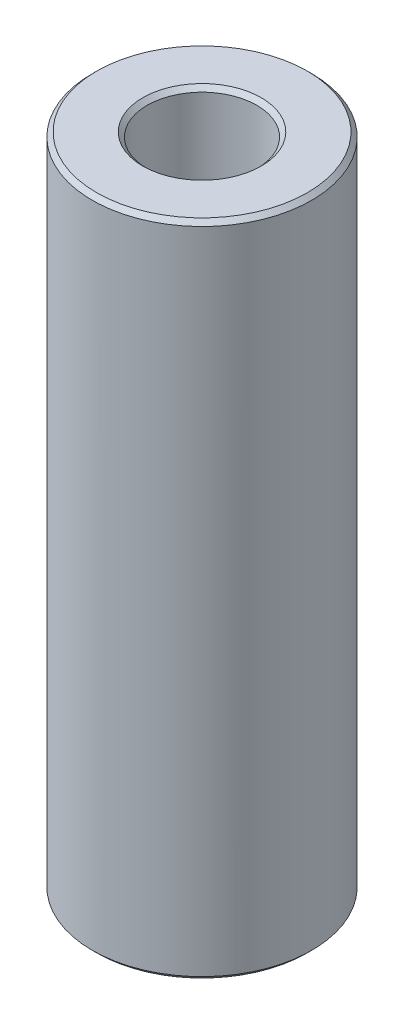
ISO-10303-21;
HEADER;
FILE_DESCRIPTION(('STEP AP214'),'2;1');
FILE_NAME('part.step','',(''),(''),'','','');
FILE_SCHEMA(('AUTOMOTIVE_DESIGN { 1 0 10303 214 1 1 1 1 }'));
ENDSEC;
DATA;
#1=APPLICATION_CONTEXT('core data for automotive mechanical design processes');
#2=APPLICATION_PROTOCOL_DEFINITION('international standard','automotive_design',2000,#1);
#3=PRODUCT_CONTEXT('',#1,'mechanical');
#4=PRODUCT('Part','Part','',(#3));
#5=PRODUCT_RELATED_PRODUCT_CATEGORY('part','',(#4));
#6=PRODUCT_DEFINITION_FORMATION('','',#4);
#7=PRODUCT_DEFINITION_CONTEXT('part definition',#1,'design');
#8=PRODUCT_DEFINITION('design','',#6,#7);
#9=PRODUCT_DEFINITION_SHAPE('','',#8);
#10=(LENGTH_UNIT() NAMED_UNIT(*) SI_UNIT(.MILLI.,.METRE.));
#11=(NAMED_UNIT(*) PLANE_ANGLE_UNIT() SI_UNIT($,.RADIAN.));
#12=(NAMED_UNIT(*) SI_UNIT($,.STERADIAN.) SOLID_ANGLE_UNIT());
#13=UNCERTAINTY_MEASURE_WITH_UNIT(LENGTH_MEASURE(1.E-05),#10,'distance_accuracy_value','');
#14=(GEOMETRIC_REPRESENTATION_CONTEXT(3) GLOBAL_UNCERTAINTY_ASSIGNED_CONTEXT((#13)) GLOBAL_UNIT_ASSIGNED_CONTEXT((#10,
#11,#12)) REPRESENTATION_CONTEXT('',''));
#15=CARTESIAN_POINT('',(0.,0.,0.));
#16=DIRECTION('',(0.,0.,1.));
#17=DIRECTION('',(1.,0.,0.));
#18=AXIS2_PLACEMENT_3D('',#15,#16,#17);
#19=CARTESIAN_POINT('',(0.,38.1,0.));
#20=DIRECTION('',(0.,-1.,0.));
#21=DIRECTION('',(0.,0.,-1.));
#22=AXIS2_PLACEMENT_3D('',#19,#20,#21);
#23=CYLINDRICAL_SURFACE('',#22,3.175);
#24=CARTESIAN_POINT('',(0.,0.253999999983989,0.));
#25=DIRECTION('',(0.,-1.,0.));
#26=DIRECTION('',(0.,0.,-1.));
#27=AXIS2_PLACEMENT_3D('',#24,#25,#26);
#28=CIRCLE('',#27,3.17499999999882);
#29=CARTESIAN_POINT('',(0.,0.253999999983989,-3.17499999999882));
#30=VERTEX_POINT('',#29);
#31=EDGE_CURVE('E29',#30,#30,#28,.T.);
#32=ORIENTED_EDGE('',*,*,#31,.T.);
#33=EDGE_LOOP('',(#32));
#34=FACE_BOUND('',#33,.T.);
#35=CARTESIAN_POINT('',(0.,37.8460000000018,0.));
#36=DIRECTION('',(0.,1.,0.));
#37=DIRECTION('',(0.,0.,1.));
#38=AXIS2_PLACEMENT_3D('',#35,#36,#37);
#39=CIRCLE('',#38,3.17500000005566);
#40=CARTESIAN_POINT('',(0.,37.8460000000018,3.17500000005566));
#41=VERTEX_POINT('',#40);
#42=EDGE_CURVE('E32',#41,#41,#39,.T.);
#43=ORIENTED_EDGE('',*,*,#42,.T.);
#44=EDGE_LOOP('',(#43));
#45=FACE_BOUND('',#44,.T.);
#46=ADVANCED_FACE('F14',(#34,#45),#23,.F.);
#47=CARTESIAN_POINT('',(0.,38.099999999929,0.));
#48=DIRECTION('',(0.,1.,0.));
#49=DIRECTION('',(0.,0.,1.));
#50=AXIS2_PLACEMENT_3D('',#47,#48,#49);
#51=CONICAL_SURFACE('',#50,3.42899999998281,0.785398163509345);
#52=ORIENTED_EDGE('',*,*,#42,.F.);
#53=EDGE_LOOP('',(#52));
#54=FACE_BOUND('',#53,.T.);
#55=CARTESIAN_POINT('',(0.,38.0999999999858,0.));
#56=DIRECTION('',(0.,1.,0.));
#57=DIRECTION('',(0.,0.,1.));
#58=AXIS2_PLACEMENT_3D('',#55,#56,#57);
#59=CIRCLE('',#58,3.42900000003965);
#60=CARTESIAN_POINT('',(0.,38.0999999999858,3.42900000003965));
#61=VERTEX_POINT('',#60);
#62=EDGE_CURVE('E17',#61,#61,#59,.F.);
#63=ORIENTED_EDGE('',*,*,#62,.F.);
#64=EDGE_LOOP('',(#63));
#65=FACE_BOUND('',#64,.T.);
#66=ADVANCED_FACE('F48',(#54,#65),#51,.F.);
#67=CARTESIAN_POINT('',(0.,0.,0.));
#68=DIRECTION('',(0.,-1.,0.));
#69=DIRECTION('',(0.,0.,-1.));
#70=AXIS2_PLACEMENT_3D('',#67,#68,#69);
#71=CONICAL_SURFACE('',#70,3.42899999998281,0.785398163397448);
#72=CARTESIAN_POINT('',(0.,0.,0.));
#73=DIRECTION('',(0.,-1.,0.));
#74=DIRECTION('',(0.,0.,-1.));
#75=AXIS2_PLACEMENT_3D('',#72,#73,#74);
#76=CIRCLE('',#75,3.42899999998281);
#77=CARTESIAN_POINT('',(0.,0.,-3.42899999998281));
#78=VERTEX_POINT('',#77);
#79=EDGE_CURVE('E39',#78,#78,#76,.T.);
#80=ORIENTED_EDGE('',*,*,#79,.T.);
#81=EDGE_LOOP('',(#80));
#82=FACE_BOUND('',#81,.T.);
#83=ORIENTED_EDGE('',*,*,#31,.F.);
#84=EDGE_LOOP('',(#83));
#85=FACE_BOUND('',#84,.T.);
#86=ADVANCED_FACE('F50',(#82,#85),#71,.F.);
#87=CARTESIAN_POINT('',(0.,38.1,0.));
#88=DIRECTION('',(0.,1.,0.));
#89=DIRECTION('',(0.,0.,1.));
#90=AXIS2_PLACEMENT_3D('',#87,#88,#89);
#91=PLANE('',#90);
#92=CARTESIAN_POINT('',(0.,38.099999999929,0.));
#93=DIRECTION('',(0.,-1.,0.));
#94=DIRECTION('',(0.,0.,-1.));
#95=AXIS2_PLACEMENT_3D('',#92,#93,#94);
#96=CIRCLE('',#95,6.09600000007049);
#97=CARTESIAN_POINT('',(0.,38.099999999929,-6.09600000007049));
#98=VERTEX_POINT('',#97);
#99=EDGE_CURVE('E37',#98,#98,#96,.T.);
#100=ORIENTED_EDGE('',*,*,#99,.F.);
#101=EDGE_LOOP('',(#100));
#102=FACE_BOUND('',#101,.T.);
#103=ORIENTED_EDGE('',*,*,#62,.T.);
#104=EDGE_LOOP('',(#103));
#105=FACE_BOUND('',#104,.T.);
#106=ADVANCED_FACE('F46',(#102,#105),#91,.T.);
#107=CARTESIAN_POINT('',(0.,0.,0.));
#108=DIRECTION('',(0.,1.,0.));
#109=DIRECTION('',(0.,0.,1.));
#110=AXIS2_PLACEMENT_3D('',#107,#108,#109);
#111=PLANE('',#110);
#112=CARTESIAN_POINT('',(0.,-5.6843418860808E-11,0.));
#113=DIRECTION('',(0.,1.,0.));
#114=DIRECTION('',(0.,0.,1.));
#115=AXIS2_PLACEMENT_3D('',#112,#113,#114);
#116=CIRCLE('',#115,6.09600000001365);
#117=CARTESIAN_POINT('',(0.,-5.6843418860808E-11,6.09600000001365));
#118=VERTEX_POINT('',#117);
#119=EDGE_CURVE('E26',#118,#118,#116,.T.);
#120=ORIENTED_EDGE('',*,*,#119,.F.);
#121=EDGE_LOOP('',(#120));
#122=FACE_BOUND('',#121,.T.);
#123=ORIENTED_EDGE('',*,*,#79,.F.);
#124=EDGE_LOOP('',(#123));
#125=FACE_BOUND('',#124,.T.);
#126=ADVANCED_FACE('F75',(#122,#125),#111,.F.);
#127=CARTESIAN_POINT('',(0.,37.8460000000587,0.));
#128=DIRECTION('',(0.,-1.,0.));
#129=DIRECTION('',(0.,0.,-1.));
#130=AXIS2_PLACEMENT_3D('',#127,#128,#129);
#131=CONICAL_SURFACE('',#130,6.34999999994079,0.785398163397448);
#132=CARTESIAN_POINT('',(0.,37.846,0.));
#133=DIRECTION('',(0.,-1.,0.));
#134=DIRECTION('',(0.,0.,-1.));
#135=AXIS2_PLACEMENT_3D('',#132,#133,#134);
#136=CIRCLE('',#135,6.35);
#137=CARTESIAN_POINT('',(0.,37.846,-6.35));
#138=VERTEX_POINT('',#137);
#139=EDGE_CURVE('E21',#138,#138,#136,.T.);
#140=ORIENTED_EDGE('',*,*,#139,.F.);
#141=EDGE_LOOP('',(#140));
#142=FACE_BOUND('',#141,.T.);
#143=ORIENTED_EDGE('',*,*,#99,.T.);
#144=EDGE_LOOP('',(#143));
#145=FACE_BOUND('',#144,.T.);
#146=ADVANCED_FACE('F68',(#142,#145),#131,.T.);
#147=CARTESIAN_POINT('',(0.,0.253999999927146,0.));
#148=DIRECTION('',(0.,1.,0.));
#149=DIRECTION('',(0.,0.,1.));
#150=AXIS2_PLACEMENT_3D('',#147,#148,#149);
#151=CONICAL_SURFACE('',#150,6.34999999999764,0.785398163397448);
#152=CARTESIAN_POINT('',(0.,0.254000000000025,0.));
#153=DIRECTION('',(0.,-1.,0.));
#154=DIRECTION('',(0.,0.,-1.));
#155=AXIS2_PLACEMENT_3D('',#152,#153,#154);
#156=CIRCLE('',#155,6.35);
#157=CARTESIAN_POINT('',(0.,0.254000000000025,-6.35));
#158=VERTEX_POINT('',#157);
#159=EDGE_CURVE('E10',#158,#158,#156,.F.);
#160=ORIENTED_EDGE('',*,*,#159,.F.);
#161=EDGE_LOOP('',(#160));
#162=FACE_BOUND('',#161,.T.);
#163=ORIENTED_EDGE('',*,*,#119,.T.);
#164=EDGE_LOOP('',(#163));
#165=FACE_BOUND('',#164,.T.);
#166=ADVANCED_FACE('F63',(#162,#165),#151,.T.);
#167=CARTESIAN_POINT('',(0.,38.1,0.));
#168=DIRECTION('',(0.,-1.,0.));
#169=DIRECTION('',(0.,0.,-1.));
#170=AXIS2_PLACEMENT_3D('',#167,#168,#169);
#171=CYLINDRICAL_SURFACE('',#170,6.35);
#172=ORIENTED_EDGE('',*,*,#159,.T.);
#173=EDGE_LOOP('',(#172));
#174=FACE_BOUND('',#173,.T.);
#175=ORIENTED_EDGE('',*,*,#139,.T.);
#176=EDGE_LOOP('',(#175));
#177=FACE_BOUND('',#176,.T.);
#178=ADVANCED_FACE('F61',(#174,#177),#171,.T.);
#179=CLOSED_SHELL('',(#46,#66,#86,#106,#126,#146,#166,#178));
#180=MANIFOLD_SOLID_BREP('B1',#179);
#181=ADVANCED_BREP_SHAPE_REPRESENTATION('',(#18,#180),#14);
#182=SHAPE_DEFINITION_REPRESENTATION(#9,#181);
ENDSEC;
END-ISO-10303-21;
